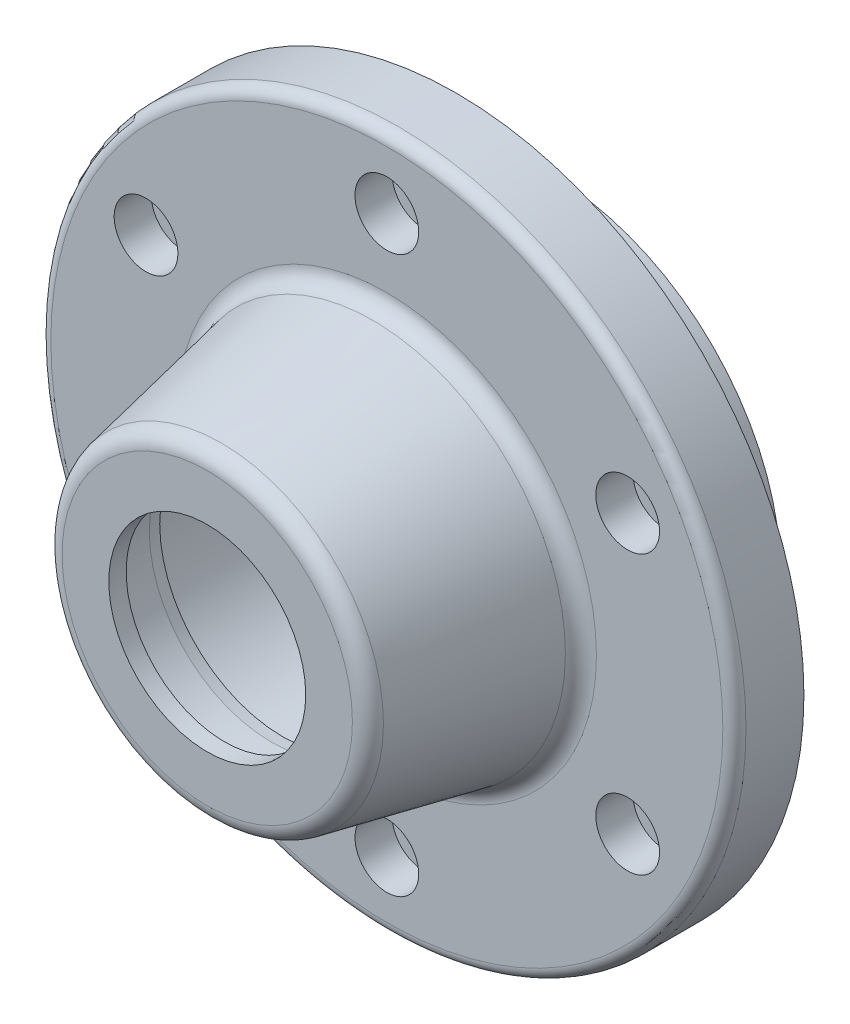
ISO-10303-21;
HEADER;
FILE_DESCRIPTION(('STEP AP214'),'2;1');
FILE_NAME('part.step','',(''),(''),'','','');
FILE_SCHEMA(('AUTOMOTIVE_DESIGN { 1 0 10303 214 1 1 1 1 }'));
ENDSEC;
DATA;
#1=APPLICATION_CONTEXT('core data for automotive mechanical design processes');
#2=APPLICATION_PROTOCOL_DEFINITION('international standard','automotive_design',2000,#1);
#3=PRODUCT_CONTEXT('',#1,'mechanical');
#4=PRODUCT('Part','Part','',(#3));
#5=PRODUCT_RELATED_PRODUCT_CATEGORY('part','',(#4));
#6=PRODUCT_DEFINITION_FORMATION('','',#4);
#7=PRODUCT_DEFINITION_CONTEXT('part definition',#1,'design');
#8=PRODUCT_DEFINITION('design','',#6,#7);
#9=PRODUCT_DEFINITION_SHAPE('','',#8);
#10=(LENGTH_UNIT() NAMED_UNIT(*) SI_UNIT(.MILLI.,.METRE.));
#11=(NAMED_UNIT(*) PLANE_ANGLE_UNIT() SI_UNIT($,.RADIAN.));
#12=(NAMED_UNIT(*) SI_UNIT($,.STERADIAN.) SOLID_ANGLE_UNIT());
#13=UNCERTAINTY_MEASURE_WITH_UNIT(LENGTH_MEASURE(1.E-05),#10,'distance_accuracy_value','');
#14=(GEOMETRIC_REPRESENTATION_CONTEXT(3) GLOBAL_UNCERTAINTY_ASSIGNED_CONTEXT((#13)) GLOBAL_UNIT_ASSIGNED_CONTEXT((#10,
#11,#12)) REPRESENTATION_CONTEXT('',''));
#15=CARTESIAN_POINT('',(0.,0.,0.));
#16=DIRECTION('',(0.,0.,1.));
#17=DIRECTION('',(1.,0.,0.));
#18=AXIS2_PLACEMENT_3D('',#15,#16,#17);
#19=CARTESIAN_POINT('',(0.,0.,82.7475601325887));
#20=DIRECTION('',(0.,0.,1.));
#21=DIRECTION('',(1.,0.,0.));
#22=AXIS2_PLACEMENT_3D('',#19,#20,#21);
#23=CYLINDRICAL_SURFACE('',#22,17.);
#24=CARTESIAN_POINT('',(0.,0.,63.));
#25=DIRECTION('',(0.,0.,1.));
#26=DIRECTION('',(1.,0.,0.));
#27=AXIS2_PLACEMENT_3D('',#24,#25,#26);
#28=CIRCLE('',#27,17.);
#29=CARTESIAN_POINT('',(17.,0.,63.));
#30=VERTEX_POINT('',#29);
#31=EDGE_CURVE('E10',#30,#30,#28,.T.);
#32=ORIENTED_EDGE('',*,*,#31,.T.);
#33=EDGE_LOOP('',(#32));
#34=FACE_BOUND('',#33,.T.);
#35=CARTESIAN_POINT('',(0.,0.,60.));
#36=DIRECTION('',(0.,0.,1.));
#37=DIRECTION('',(1.,0.,0.));
#38=AXIS2_PLACEMENT_3D('',#35,#36,#37);
#39=CIRCLE('',#38,17.);
#40=CARTESIAN_POINT('',(17.,0.,60.));
#41=VERTEX_POINT('',#40);
#42=EDGE_CURVE('E143',#41,#41,#39,.T.);
#43=ORIENTED_EDGE('',*,*,#42,.F.);
#44=EDGE_LOOP('',(#43));
#45=FACE_BOUND('',#44,.T.);
#46=ADVANCED_FACE('F36',(#34,#45),#23,.F.);
#47=CARTESIAN_POINT('',(0.,-17.,63.));
#48=DIRECTION('',(0.,0.,1.));
#49=DIRECTION('',(1.,0.,0.));
#50=AXIS2_PLACEMENT_3D('',#47,#48,#49);
#51=PLANE('',#50);
#52=CARTESIAN_POINT('',(0.,0.,63.));
#53=DIRECTION('',(0.,0.,1.));
#54=DIRECTION('',(1.,0.,0.));
#55=AXIS2_PLACEMENT_3D('',#52,#53,#54);
#56=CIRCLE('',#55,25.0582579729272);
#57=CARTESIAN_POINT('',(25.0582579729272,0.,63.));
#58=VERTEX_POINT('',#57);
#59=EDGE_CURVE('E43',#58,#58,#56,.T.);
#60=ORIENTED_EDGE('',*,*,#59,.T.);
#61=EDGE_LOOP('',(#60));
#62=FACE_BOUND('',#61,.T.);
#63=ORIENTED_EDGE('',*,*,#31,.F.);
#64=EDGE_LOOP('',(#63));
#65=FACE_BOUND('',#64,.T.);
#66=ADVANCED_FACE('F280',(#62,#65),#51,.T.);
#67=CARTESIAN_POINT('',(0.,0.,60.));
#68=DIRECTION('',(0.,0.,1.));
#69=DIRECTION('',(1.,0.,0.));
#70=AXIS2_PLACEMENT_3D('',#67,#68,#69);
#71=TOROIDAL_SURFACE('',#70,25.0582579729272,3.00000000000001);
#72=CARTESIAN_POINT('',(0.,0.,60.5883484054146));
#73=DIRECTION('',(0.,0.,1.));
#74=DIRECTION('',(1.,0.,0.));
#75=AXIS2_PLACEMENT_3D('',#72,#73,#74);
#76=CIRCLE('',#75,28.);
#77=CARTESIAN_POINT('',(28.,0.,60.5883484054146));
#78=VERTEX_POINT('',#77);
#79=EDGE_CURVE('E48',#78,#78,#76,.T.);
#80=ORIENTED_EDGE('',*,*,#79,.T.);
#81=EDGE_LOOP('',(#80));
#82=FACE_BOUND('',#81,.T.);
#83=ORIENTED_EDGE('',*,*,#59,.F.);
#84=EDGE_LOOP('',(#83));
#85=FACE_BOUND('',#84,.T.);
#86=ADVANCED_FACE('F274',(#82,#85),#71,.T.);
#87=CARTESIAN_POINT('',(0.,0.,60.5883484054146));
#88=DIRECTION('',(0.,0.,-1.));
#89=DIRECTION('',(-1.,0.,0.));
#90=AXIS2_PLACEMENT_3D('',#87,#88,#89);
#91=CONICAL_SURFACE('',#90,28.,0.197395559849877);
#92=CARTESIAN_POINT('',(0.,0.,34.4116515945855));
#93=DIRECTION('',(0.,0.,1.));
#94=DIRECTION('',(1.,0.,0.));
#95=AXIS2_PLACEMENT_3D('',#92,#93,#94);
#96=CIRCLE('',#95,33.2353393621657);
#97=CARTESIAN_POINT('',(33.2353393621657,0.,34.4116515945855));
#98=VERTEX_POINT('',#97);
#99=EDGE_CURVE('E53',#98,#98,#96,.T.);
#100=ORIENTED_EDGE('',*,*,#99,.T.);
#101=EDGE_LOOP('',(#100));
#102=FACE_BOUND('',#101,.T.);
#103=ORIENTED_EDGE('',*,*,#79,.F.);
#104=EDGE_LOOP('',(#103));
#105=FACE_BOUND('',#104,.T.);
#106=ADVANCED_FACE('F268',(#102,#105),#91,.T.);
#107=CARTESIAN_POINT('',(0.,0.,35.));
#108=DIRECTION('',(0.,0.,1.));
#109=DIRECTION('',(1.,0.,0.));
#110=AXIS2_PLACEMENT_3D('',#107,#108,#109);
#111=TOROIDAL_SURFACE('',#110,36.1770813892385,3.00000000000001);
#112=CARTESIAN_POINT('',(0.,0.,32.));
#113=DIRECTION('',(0.,0.,1.));
#114=DIRECTION('',(1.,0.,0.));
#115=AXIS2_PLACEMENT_3D('',#112,#113,#114);
#116=CIRCLE('',#115,36.1770813892385);
#117=CARTESIAN_POINT('',(36.1770813892385,0.,32.));
#118=VERTEX_POINT('',#117);
#119=EDGE_CURVE('E59',#118,#118,#116,.T.);
#120=ORIENTED_EDGE('',*,*,#119,.T.);
#121=EDGE_LOOP('',(#120));
#122=FACE_BOUND('',#121,.T.);
#123=ORIENTED_EDGE('',*,*,#99,.F.);
#124=EDGE_LOOP('',(#123));
#125=FACE_BOUND('',#124,.T.);
#126=ADVANCED_FACE('F250',(#122,#125),#111,.F.);
#127=CARTESIAN_POINT('',(0.,-36.1770813892385,32.));
#128=DIRECTION('',(0.,0.,1.));
#129=DIRECTION('',(1.,0.,0.));
#130=AXIS2_PLACEMENT_3D('',#127,#128,#129);
#131=PLANE('',#130);
#132=CARTESIAN_POINT('',(-41.5692193816528,24.0000000000005,32.));
#133=DIRECTION('',(0.,0.,1.));
#134=DIRECTION('',(1.,0.,0.));
#135=AXIS2_PLACEMENT_3D('',#132,#133,#134);
#136=CIRCLE('',#135,5.50000000000001);
#137=CARTESIAN_POINT('',(-36.0692193816528,24.0000000000005,32.));
#138=VERTEX_POINT('',#137);
#139=EDGE_CURVE('E239',#138,#138,#136,.T.);
#140=ORIENTED_EDGE('',*,*,#139,.F.);
#141=EDGE_LOOP('',(#140));
#142=FACE_BOUND('',#141,.T.);
#143=CARTESIAN_POINT('',(-41.5692193816533,-23.9999999999996,32.));
#144=DIRECTION('',(0.,0.,1.));
#145=DIRECTION('',(1.,0.,0.));
#146=AXIS2_PLACEMENT_3D('',#143,#144,#145);
#147=CIRCLE('',#146,5.50000000000001);
#148=CARTESIAN_POINT('',(-36.0692193816533,-23.9999999999996,32.));
#149=VERTEX_POINT('',#148);
#150=EDGE_CURVE('E223',#149,#149,#147,.T.);
#151=ORIENTED_EDGE('',*,*,#150,.F.);
#152=EDGE_LOOP('',(#151));
#153=FACE_BOUND('',#152,.T.);
#154=CARTESIAN_POINT('',(0.,-48.,32.));
#155=DIRECTION('',(0.,0.,1.));
#156=DIRECTION('',(1.,0.,0.));
#157=AXIS2_PLACEMENT_3D('',#154,#155,#156);
#158=CIRCLE('',#157,5.50000000000001);
#159=CARTESIAN_POINT('',(5.50000000000001,-48.,32.));
#160=VERTEX_POINT('',#159);
#161=EDGE_CURVE('E207',#160,#160,#158,.T.);
#162=ORIENTED_EDGE('',*,*,#161,.F.);
#163=EDGE_LOOP('',(#162));
#164=FACE_BOUND('',#163,.T.);
#165=CARTESIAN_POINT('',(41.5692193816529,-24.0000000000002,32.));
#166=DIRECTION('',(0.,0.,1.));
#167=DIRECTION('',(1.,0.,0.));
#168=AXIS2_PLACEMENT_3D('',#165,#166,#167);
#169=CIRCLE('',#168,5.50000000000001);
#170=CARTESIAN_POINT('',(47.069219381653,-24.0000000000002,32.));
#171=VERTEX_POINT('',#170);
#172=EDGE_CURVE('E191',#171,#171,#169,.T.);
#173=ORIENTED_EDGE('',*,*,#172,.F.);
#174=EDGE_LOOP('',(#173));
#175=FACE_BOUND('',#174,.T.);
#176=CARTESIAN_POINT('',(41.5692193816531,23.9999999999999,32.));
#177=DIRECTION('',(0.,0.,1.));
#178=DIRECTION('',(1.,0.,0.));
#179=AXIS2_PLACEMENT_3D('',#176,#177,#178);
#180=CIRCLE('',#179,5.50000000000001);
#181=CARTESIAN_POINT('',(47.0692193816531,23.9999999999999,32.));
#182=VERTEX_POINT('',#181);
#183=EDGE_CURVE('E175',#182,#182,#180,.T.);
#184=ORIENTED_EDGE('',*,*,#183,.F.);
#185=EDGE_LOOP('',(#184));
#186=FACE_BOUND('',#185,.T.);
#187=CARTESIAN_POINT('',(0.,48.,32.));
#188=DIRECTION('',(0.,0.,1.));
#189=DIRECTION('',(1.,0.,0.));
#190=AXIS2_PLACEMENT_3D('',#187,#188,#189);
#191=CIRCLE('',#190,5.50000000000001);
#192=CARTESIAN_POINT('',(5.50000000000001,48.,32.));
#193=VERTEX_POINT('',#192);
#194=EDGE_CURVE('E159',#193,#193,#191,.T.);
#195=ORIENTED_EDGE('',*,*,#194,.F.);
#196=EDGE_LOOP('',(#195));
#197=FACE_BOUND('',#196,.T.);
#198=CARTESIAN_POINT('',(0.,0.,32.));
#199=DIRECTION('',(0.,0.,1.));
#200=DIRECTION('',(1.,0.,0.));
#201=AXIS2_PLACEMENT_3D('',#198,#199,#200);
#202=CIRCLE('',#201,58.);
#203=CARTESIAN_POINT('',(58.,0.,32.));
#204=VERTEX_POINT('',#203);
#205=EDGE_CURVE('E63',#204,#204,#202,.T.);
#206=ORIENTED_EDGE('',*,*,#205,.T.);
#207=EDGE_LOOP('',(#206));
#208=FACE_BOUND('',#207,.T.);
#209=ORIENTED_EDGE('',*,*,#119,.F.);
#210=EDGE_LOOP('',(#209));
#211=FACE_BOUND('',#210,.T.);
#212=ADVANCED_FACE('F246',(#142,#153,#164,#175,#186,#197,#208,#211),#131,.T.);
#213=CARTESIAN_POINT('',(0.,0.,30.));
#214=DIRECTION('',(0.,0.,1.));
#215=DIRECTION('',(1.,0.,0.));
#216=AXIS2_PLACEMENT_3D('',#213,#214,#215);
#217=TOROIDAL_SURFACE('',#216,58.,2.00000000000001);
#218=CARTESIAN_POINT('',(0.,0.,30.));
#219=DIRECTION('',(0.,0.,1.));
#220=DIRECTION('',(1.,0.,0.));
#221=AXIS2_PLACEMENT_3D('',#218,#219,#220);
#222=CIRCLE('',#221,60.);
#223=CARTESIAN_POINT('',(60.,0.,30.));
#224=VERTEX_POINT('',#223);
#225=EDGE_CURVE('E67',#224,#224,#222,.T.);
#226=ORIENTED_EDGE('',*,*,#225,.T.);
#227=EDGE_LOOP('',(#226));
#228=FACE_BOUND('',#227,.T.);
#229=ORIENTED_EDGE('',*,*,#205,.F.);
#230=EDGE_LOOP('',(#229));
#231=FACE_BOUND('',#230,.T.);
#232=ADVANCED_FACE('F249',(#228,#231),#217,.T.);
#233=CARTESIAN_POINT('',(0.,0.,82.7475601325887));
#234=DIRECTION('',(0.,0.,1.));
#235=DIRECTION('',(1.,0.,0.));
#236=AXIS2_PLACEMENT_3D('',#233,#234,#235);
#237=CYLINDRICAL_SURFACE('',#236,60.);
#238=CARTESIAN_POINT('',(0.,0.,20.));
#239=DIRECTION('',(0.,0.,1.));
#240=DIRECTION('',(1.,0.,0.));
#241=AXIS2_PLACEMENT_3D('',#238,#239,#240);
#242=CIRCLE('',#241,60.);
#243=CARTESIAN_POINT('',(60.,0.,20.));
#244=VERTEX_POINT('',#243);
#245=EDGE_CURVE('E71',#244,#244,#242,.T.);
#246=ORIENTED_EDGE('',*,*,#245,.T.);
#247=EDGE_LOOP('',(#246));
#248=FACE_BOUND('',#247,.T.);
#249=ORIENTED_EDGE('',*,*,#225,.F.);
#250=EDGE_LOOP('',(#249));
#251=FACE_BOUND('',#250,.T.);
#252=ADVANCED_FACE('F397',(#248,#251),#237,.T.);
#253=CARTESIAN_POINT('',(0.,-60.,20.));
#254=DIRECTION('',(0.,0.,-1.));
#255=DIRECTION('',(-1.,0.,0.));
#256=AXIS2_PLACEMENT_3D('',#253,#254,#255);
#257=PLANE('',#256);
#258=CARTESIAN_POINT('',(-41.5692193816528,24.0000000000005,20.));
#259=DIRECTION('',(0.,0.,-1.));
#260=DIRECTION('',(-1.,0.,0.));
#261=AXIS2_PLACEMENT_3D('',#258,#259,#260);
#262=CIRCLE('',#261,3.50000000000001);
#263=CARTESIAN_POINT('',(-45.0692193816528,24.0000000000005,20.));
#264=VERTEX_POINT('',#263);
#265=EDGE_CURVE('E227',#264,#264,#262,.T.);
#266=ORIENTED_EDGE('',*,*,#265,.F.);
#267=EDGE_LOOP('',(#266));
#268=FACE_BOUND('',#267,.T.);
#269=CARTESIAN_POINT('',(-41.5692193816533,-23.9999999999996,20.));
#270=DIRECTION('',(0.,0.,-1.));
#271=DIRECTION('',(-1.,0.,0.));
#272=AXIS2_PLACEMENT_3D('',#269,#270,#271);
#273=CIRCLE('',#272,3.50000000000001);
#274=CARTESIAN_POINT('',(-45.0692193816533,-23.9999999999996,20.));
#275=VERTEX_POINT('',#274);
#276=EDGE_CURVE('E211',#275,#275,#273,.T.);
#277=ORIENTED_EDGE('',*,*,#276,.F.);
#278=EDGE_LOOP('',(#277));
#279=FACE_BOUND('',#278,.T.);
#280=CARTESIAN_POINT('',(0.,-48.,20.));
#281=DIRECTION('',(0.,0.,-1.));
#282=DIRECTION('',(-1.,0.,0.));
#283=AXIS2_PLACEMENT_3D('',#280,#281,#282);
#284=CIRCLE('',#283,3.50000000000001);
#285=CARTESIAN_POINT('',(-3.50000000000001,-48.,20.));
#286=VERTEX_POINT('',#285);
#287=EDGE_CURVE('E195',#286,#286,#284,.T.);
#288=ORIENTED_EDGE('',*,*,#287,.F.);
#289=EDGE_LOOP('',(#288));
#290=FACE_BOUND('',#289,.T.);
#291=CARTESIAN_POINT('',(41.5692193816529,-24.0000000000002,20.));
#292=DIRECTION('',(0.,0.,-1.));
#293=DIRECTION('',(-1.,0.,0.));
#294=AXIS2_PLACEMENT_3D('',#291,#292,#293);
#295=CIRCLE('',#294,3.50000000000001);
#296=CARTESIAN_POINT('',(38.0692193816529,-24.0000000000002,20.));
#297=VERTEX_POINT('',#296);
#298=EDGE_CURVE('E179',#297,#297,#295,.T.);
#299=ORIENTED_EDGE('',*,*,#298,.F.);
#300=EDGE_LOOP('',(#299));
#301=FACE_BOUND('',#300,.T.);
#302=CARTESIAN_POINT('',(41.5692193816531,23.9999999999999,20.));
#303=DIRECTION('',(0.,0.,-1.));
#304=DIRECTION('',(-1.,0.,0.));
#305=AXIS2_PLACEMENT_3D('',#302,#303,#304);
#306=CIRCLE('',#305,3.50000000000001);
#307=CARTESIAN_POINT('',(38.0692193816531,23.9999999999999,20.));
#308=VERTEX_POINT('',#307);
#309=EDGE_CURVE('E163',#308,#308,#306,.T.);
#310=ORIENTED_EDGE('',*,*,#309,.F.);
#311=EDGE_LOOP('',(#310));
#312=FACE_BOUND('',#311,.T.);
#313=CARTESIAN_POINT('',(0.,48.,20.));
#314=DIRECTION('',(0.,0.,-1.));
#315=DIRECTION('',(-1.,0.,0.));
#316=AXIS2_PLACEMENT_3D('',#313,#314,#315);
#317=CIRCLE('',#316,3.50000000000001);
#318=CARTESIAN_POINT('',(-3.50000000000001,48.,20.));
#319=VERTEX_POINT('',#318);
#320=EDGE_CURVE('E147',#319,#319,#317,.T.);
#321=ORIENTED_EDGE('',*,*,#320,.F.);
#322=EDGE_LOOP('',(#321));
#323=FACE_BOUND('',#322,.T.);
#324=CARTESIAN_POINT('',(0.,0.,20.));
#325=DIRECTION('',(0.,0.,1.));
#326=DIRECTION('',(1.,0.,0.));
#327=AXIS2_PLACEMENT_3D('',#324,#325,#326);
#328=CIRCLE('',#327,40.);
#329=CARTESIAN_POINT('',(40.,0.,20.));
#330=VERTEX_POINT('',#329);
#331=EDGE_CURVE('E75',#330,#330,#328,.T.);
#332=ORIENTED_EDGE('',*,*,#331,.T.);
#333=EDGE_LOOP('',(#332));
#334=FACE_BOUND('',#333,.T.);
#335=ORIENTED_EDGE('',*,*,#245,.F.);
#336=EDGE_LOOP('',(#335));
#337=FACE_BOUND('',#336,.T.);
#338=ADVANCED_FACE('F391',(#268,#279,#290,#301,#312,#323,#334,#337),#257,.T.);
#339=CARTESIAN_POINT('',(0.,0.,82.7475601325887));
#340=DIRECTION('',(0.,0.,1.));
#341=DIRECTION('',(1.,0.,0.));
#342=AXIS2_PLACEMENT_3D('',#339,#340,#341);
#343=CYLINDRICAL_SURFACE('',#342,40.);
#344=CARTESIAN_POINT('',(0.,0.,4.));
#345=DIRECTION('',(0.,0.,1.));
#346=DIRECTION('',(1.,0.,0.));
#347=AXIS2_PLACEMENT_3D('',#344,#345,#346);
#348=CIRCLE('',#347,40.);
#349=CARTESIAN_POINT('',(40.,0.,4.));
#350=VERTEX_POINT('',#349);
#351=EDGE_CURVE('E79',#350,#350,#348,.T.);
#352=ORIENTED_EDGE('',*,*,#351,.T.);
#353=EDGE_LOOP('',(#352));
#354=FACE_BOUND('',#353,.T.);
#355=ORIENTED_EDGE('',*,*,#331,.F.);
#356=EDGE_LOOP('',(#355));
#357=FACE_BOUND('',#356,.T.);
#358=ADVANCED_FACE('F385',(#354,#357),#343,.T.);
#359=CARTESIAN_POINT('',(0.,-40.,4.));
#360=DIRECTION('',(0.,0.,-1.));
#361=DIRECTION('',(-1.,0.,0.));
#362=AXIS2_PLACEMENT_3D('',#359,#360,#361);
#363=PLANE('',#362);
#364=CARTESIAN_POINT('',(0.,0.,4.));
#365=DIRECTION('',(0.,0.,1.));
#366=DIRECTION('',(1.,0.,0.));
#367=AXIS2_PLACEMENT_3D('',#364,#365,#366);
#368=CIRCLE('',#367,31.);
#369=CARTESIAN_POINT('',(31.,0.,4.));
#370=VERTEX_POINT('',#369);
#371=EDGE_CURVE('E83',#370,#370,#368,.T.);
#372=ORIENTED_EDGE('',*,*,#371,.T.);
#373=EDGE_LOOP('',(#372));
#374=FACE_BOUND('',#373,.T.);
#375=ORIENTED_EDGE('',*,*,#351,.F.);
#376=EDGE_LOOP('',(#375));
#377=FACE_BOUND('',#376,.T.);
#378=ADVANCED_FACE('F379',(#374,#377),#363,.T.);
#379=CARTESIAN_POINT('',(0.,0.,82.7475601325887));
#380=DIRECTION('',(0.,0.,1.));
#381=DIRECTION('',(1.,0.,0.));
#382=AXIS2_PLACEMENT_3D('',#379,#380,#381);
#383=CYLINDRICAL_SURFACE('',#382,31.);
#384=CARTESIAN_POINT('',(0.,0.,0.));
#385=DIRECTION('',(0.,0.,1.));
#386=DIRECTION('',(1.,0.,0.));
#387=AXIS2_PLACEMENT_3D('',#384,#385,#386);
#388=CIRCLE('',#387,31.);
#389=CARTESIAN_POINT('',(31.,0.,0.));
#390=VERTEX_POINT('',#389);
#391=EDGE_CURVE('E87',#390,#390,#388,.T.);
#392=ORIENTED_EDGE('',*,*,#391,.T.);
#393=EDGE_LOOP('',(#392));
#394=FACE_BOUND('',#393,.T.);
#395=ORIENTED_EDGE('',*,*,#371,.F.);
#396=EDGE_LOOP('',(#395));
#397=FACE_BOUND('',#396,.T.);
#398=ADVANCED_FACE('F373',(#394,#397),#383,.T.);
#399=CARTESIAN_POINT('',(0.,-31.,0.));
#400=DIRECTION('',(0.,0.,-1.));
#401=DIRECTION('',(-1.,0.,0.));
#402=AXIS2_PLACEMENT_3D('',#399,#400,#401);
#403=PLANE('',#402);
#404=CARTESIAN_POINT('',(0.,0.,0.));
#405=DIRECTION('',(0.,0.,1.));
#406=DIRECTION('',(1.,0.,0.));
#407=AXIS2_PLACEMENT_3D('',#404,#405,#406);
#408=CIRCLE('',#407,23.75);
#409=CARTESIAN_POINT('',(23.75,0.,0.));
#410=VERTEX_POINT('',#409);
#411=EDGE_CURVE('E91',#410,#410,#408,.T.);
#412=ORIENTED_EDGE('',*,*,#411,.T.);
#413=EDGE_LOOP('',(#412));
#414=FACE_BOUND('',#413,.T.);
#415=ORIENTED_EDGE('',*,*,#391,.F.);
#416=EDGE_LOOP('',(#415));
#417=FACE_BOUND('',#416,.T.);
#418=ADVANCED_FACE('F367',(#414,#417),#403,.T.);
#419=CARTESIAN_POINT('',(0.,0.,82.7475601325887));
#420=DIRECTION('',(0.,0.,1.));
#421=DIRECTION('',(1.,0.,0.));
#422=AXIS2_PLACEMENT_3D('',#419,#420,#421);
#423=CYLINDRICAL_SURFACE('',#422,23.75);
#424=CARTESIAN_POINT('',(0.,0.,3.5));
#425=DIRECTION('',(0.,0.,1.));
#426=DIRECTION('',(1.,0.,0.));
#427=AXIS2_PLACEMENT_3D('',#424,#425,#426);
#428=CIRCLE('',#427,23.75);
#429=CARTESIAN_POINT('',(23.75,0.,3.5));
#430=VERTEX_POINT('',#429);
#431=EDGE_CURVE('E95',#430,#430,#428,.T.);
#432=ORIENTED_EDGE('',*,*,#431,.T.);
#433=EDGE_LOOP('',(#432));
#434=FACE_BOUND('',#433,.T.);
#435=ORIENTED_EDGE('',*,*,#411,.F.);
#436=EDGE_LOOP('',(#435));
#437=FACE_BOUND('',#436,.T.);
#438=ADVANCED_FACE('F361',(#434,#437),#423,.F.);
#439=CARTESIAN_POINT('',(0.,-23.75,3.5));
#440=DIRECTION('',(0.,0.,1.));
#441=DIRECTION('',(1.,0.,0.));
#442=AXIS2_PLACEMENT_3D('',#439,#440,#441);
#443=PLANE('',#442);
#444=CARTESIAN_POINT('',(0.,0.,3.5));
#445=DIRECTION('',(0.,0.,1.));
#446=DIRECTION('',(1.,0.,0.));
#447=AXIS2_PLACEMENT_3D('',#444,#445,#446);
#448=CIRCLE('',#447,24.75);
#449=CARTESIAN_POINT('',(24.75,0.,3.5));
#450=VERTEX_POINT('',#449);
#451=EDGE_CURVE('E99',#450,#450,#448,.T.);
#452=ORIENTED_EDGE('',*,*,#451,.T.);
#453=EDGE_LOOP('',(#452));
#454=FACE_BOUND('',#453,.T.);
#455=ORIENTED_EDGE('',*,*,#431,.F.);
#456=EDGE_LOOP('',(#455));
#457=FACE_BOUND('',#456,.T.);
#458=ADVANCED_FACE('F355',(#454,#457),#443,.T.);
#459=CARTESIAN_POINT('',(0.,0.,82.7475601325887));
#460=DIRECTION('',(0.,0.,1.));
#461=DIRECTION('',(1.,0.,0.));
#462=AXIS2_PLACEMENT_3D('',#459,#460,#461);
#463=CYLINDRICAL_SURFACE('',#462,24.75);
#464=CARTESIAN_POINT('',(0.,0.,5.35000000000001));
#465=DIRECTION('',(0.,0.,1.));
#466=DIRECTION('',(1.,0.,0.));
#467=AXIS2_PLACEMENT_3D('',#464,#465,#466);
#468=CIRCLE('',#467,24.75);
#469=CARTESIAN_POINT('',(24.75,0.,5.35000000000001));
#470=VERTEX_POINT('',#469);
#471=EDGE_CURVE('E103',#470,#470,#468,.T.);
#472=ORIENTED_EDGE('',*,*,#471,.T.);
#473=EDGE_LOOP('',(#472));
#474=FACE_BOUND('',#473,.T.);
#475=ORIENTED_EDGE('',*,*,#451,.F.);
#476=EDGE_LOOP('',(#475));
#477=FACE_BOUND('',#476,.T.);
#478=ADVANCED_FACE('F349',(#474,#477),#463,.F.);
#479=CARTESIAN_POINT('',(0.,-24.75,5.35));
#480=DIRECTION('',(0.,0.,-1.));
#481=DIRECTION('',(-1.,0.,0.));
#482=AXIS2_PLACEMENT_3D('',#479,#480,#481);
#483=PLANE('',#482);
#484=CARTESIAN_POINT('',(0.,0.,5.35000000000001));
#485=DIRECTION('',(0.,0.,1.));
#486=DIRECTION('',(1.,0.,0.));
#487=AXIS2_PLACEMENT_3D('',#484,#485,#486);
#488=CIRCLE('',#487,23.5);
#489=CARTESIAN_POINT('',(23.5,0.,5.35000000000001));
#490=VERTEX_POINT('',#489);
#491=EDGE_CURVE('E107',#490,#490,#488,.T.);
#492=ORIENTED_EDGE('',*,*,#491,.T.);
#493=EDGE_LOOP('',(#492));
#494=FACE_BOUND('',#493,.T.);
#495=ORIENTED_EDGE('',*,*,#471,.F.);
#496=EDGE_LOOP('',(#495));
#497=FACE_BOUND('',#496,.T.);
#498=ADVANCED_FACE('F343',(#494,#497),#483,.T.);
#499=CARTESIAN_POINT('',(0.,0.,82.7475601325887));
#500=DIRECTION('',(0.,0.,1.));
#501=DIRECTION('',(1.,0.,0.));
#502=AXIS2_PLACEMENT_3D('',#499,#500,#501);
#503=CYLINDRICAL_SURFACE('',#502,23.5);
#504=CARTESIAN_POINT('',(0.,0.,21.5));
#505=DIRECTION('',(0.,0.,1.));
#506=DIRECTION('',(1.,0.,0.));
#507=AXIS2_PLACEMENT_3D('',#504,#505,#506);
#508=CIRCLE('',#507,23.5);
#509=CARTESIAN_POINT('',(23.5,0.,21.5));
#510=VERTEX_POINT('',#509);
#511=EDGE_CURVE('E111',#510,#510,#508,.T.);
#512=ORIENTED_EDGE('',*,*,#511,.T.);
#513=EDGE_LOOP('',(#512));
#514=FACE_BOUND('',#513,.T.);
#515=ORIENTED_EDGE('',*,*,#491,.F.);
#516=EDGE_LOOP('',(#515));
#517=FACE_BOUND('',#516,.T.);
#518=ADVANCED_FACE('F337',(#514,#517),#503,.F.);
#519=CARTESIAN_POINT('',(0.,0.,23.5));
#520=DIRECTION('',(0.,0.,1.));
#521=DIRECTION('',(1.,0.,0.));
#522=AXIS2_PLACEMENT_3D('',#519,#520,#521);
#523=TOROIDAL_SURFACE('',#522,23.5,2.);
#524=CARTESIAN_POINT('',(0.,0.,23.5));
#525=DIRECTION('',(0.,0.,1.));
#526=DIRECTION('',(1.,0.,0.));
#527=AXIS2_PLACEMENT_3D('',#524,#525,#526);
#528=CIRCLE('',#527,25.5);
#529=CARTESIAN_POINT('',(25.5,0.,23.5));
#530=VERTEX_POINT('',#529);
#531=EDGE_CURVE('E115',#530,#530,#528,.T.);
#532=ORIENTED_EDGE('',*,*,#531,.T.);
#533=EDGE_LOOP('',(#532));
#534=FACE_BOUND('',#533,.T.);
#535=ORIENTED_EDGE('',*,*,#511,.F.);
#536=EDGE_LOOP('',(#535));
#537=FACE_BOUND('',#536,.T.);
#538=ADVANCED_FACE('F331',(#534,#537),#523,.F.);
#539=CARTESIAN_POINT('',(0.,0.,82.7475601325887));
#540=DIRECTION('',(0.,0.,1.));
#541=DIRECTION('',(1.,0.,0.));
#542=AXIS2_PLACEMENT_3D('',#539,#540,#541);
#543=CYLINDRICAL_SURFACE('',#542,25.5);
#544=CARTESIAN_POINT('',(0.,0.,32.));
#545=DIRECTION('',(0.,0.,1.));
#546=DIRECTION('',(1.,0.,0.));
#547=AXIS2_PLACEMENT_3D('',#544,#545,#546);
#548=CIRCLE('',#547,25.5);
#549=CARTESIAN_POINT('',(25.5,0.,32.));
#550=VERTEX_POINT('',#549);
#551=EDGE_CURVE('E119',#550,#550,#548,.T.);
#552=ORIENTED_EDGE('',*,*,#551,.T.);
#553=EDGE_LOOP('',(#552));
#554=FACE_BOUND('',#553,.T.);
#555=ORIENTED_EDGE('',*,*,#531,.F.);
#556=EDGE_LOOP('',(#555));
#557=FACE_BOUND('',#556,.T.);
#558=ADVANCED_FACE('F325',(#554,#557),#543,.F.);
#559=CARTESIAN_POINT('',(0.,0.,32.));
#560=DIRECTION('',(0.,0.,1.));
#561=DIRECTION('',(1.,0.,0.));
#562=AXIS2_PLACEMENT_3D('',#559,#560,#561);
#563=TOROIDAL_SURFACE('',#562,23.5,2.00000000000001);
#564=CARTESIAN_POINT('',(0.,0.,34.));
#565=DIRECTION('',(0.,0.,1.));
#566=DIRECTION('',(1.,0.,0.));
#567=AXIS2_PLACEMENT_3D('',#564,#565,#566);
#568=CIRCLE('',#567,23.5);
#569=CARTESIAN_POINT('',(23.5,0.,34.));
#570=VERTEX_POINT('',#569);
#571=EDGE_CURVE('E123',#570,#570,#568,.T.);
#572=ORIENTED_EDGE('',*,*,#571,.T.);
#573=EDGE_LOOP('',(#572));
#574=FACE_BOUND('',#573,.T.);
#575=ORIENTED_EDGE('',*,*,#551,.F.);
#576=EDGE_LOOP('',(#575));
#577=FACE_BOUND('',#576,.T.);
#578=ADVANCED_FACE('F319',(#574,#577),#563,.F.);
#579=CARTESIAN_POINT('',(0.,0.,82.7475601325887));
#580=DIRECTION('',(0.,0.,1.));
#581=DIRECTION('',(1.,0.,0.));
#582=AXIS2_PLACEMENT_3D('',#579,#580,#581);
#583=CYLINDRICAL_SURFACE('',#582,23.5);
#584=CARTESIAN_POINT('',(0.,0.,50.));
#585=DIRECTION('',(0.,0.,1.));
#586=DIRECTION('',(1.,0.,0.));
#587=AXIS2_PLACEMENT_3D('',#584,#585,#586);
#588=CIRCLE('',#587,23.5);
#589=CARTESIAN_POINT('',(23.5,0.,50.));
#590=VERTEX_POINT('',#589);
#591=EDGE_CURVE('E127',#590,#590,#588,.T.);
#592=ORIENTED_EDGE('',*,*,#591,.T.);
#593=EDGE_LOOP('',(#592));
#594=FACE_BOUND('',#593,.T.);
#595=ORIENTED_EDGE('',*,*,#571,.F.);
#596=EDGE_LOOP('',(#595));
#597=FACE_BOUND('',#596,.T.);
#598=ADVANCED_FACE('F313',(#594,#597),#583,.F.);
#599=CARTESIAN_POINT('',(0.,-23.5,50.));
#600=DIRECTION('',(0.,0.,-1.));
#601=DIRECTION('',(-1.,0.,0.));
#602=AXIS2_PLACEMENT_3D('',#599,#600,#601);
#603=PLANE('',#602);
#604=CARTESIAN_POINT('',(0.,0.,50.));
#605=DIRECTION('',(0.,0.,1.));
#606=DIRECTION('',(1.,0.,0.));
#607=AXIS2_PLACEMENT_3D('',#604,#605,#606);
#608=CIRCLE('',#607,21.2102084705314);
#609=CARTESIAN_POINT('',(21.2102084705314,0.,50.));
#610=VERTEX_POINT('',#609);
#611=EDGE_CURVE('E131',#610,#610,#608,.T.);
#612=ORIENTED_EDGE('',*,*,#611,.T.);
#613=EDGE_LOOP('',(#612));
#614=FACE_BOUND('',#613,.T.);
#615=ORIENTED_EDGE('',*,*,#591,.F.);
#616=EDGE_LOOP('',(#615));
#617=FACE_BOUND('',#616,.T.);
#618=ADVANCED_FACE('F307',(#614,#617),#603,.T.);
#619=CARTESIAN_POINT('',(0.,0.,50.));
#620=DIRECTION('',(0.,0.,-1.));
#621=DIRECTION('',(-1.,0.,0.));
#622=AXIS2_PLACEMENT_3D('',#619,#620,#621);
#623=CONICAL_SURFACE('',#622,21.2102084705314,0.10471975511966);
#624=CARTESIAN_POINT('',(0.,0.,52.));
#625=DIRECTION('',(0.,0.,1.));
#626=DIRECTION('',(1.,0.,0.));
#627=AXIS2_PLACEMENT_3D('',#624,#625,#626);
#628=CIRCLE('',#627,21.);
#629=CARTESIAN_POINT('',(21.,0.,52.));
#630=VERTEX_POINT('',#629);
#631=EDGE_CURVE('E135',#630,#630,#628,.T.);
#632=ORIENTED_EDGE('',*,*,#631,.T.);
#633=EDGE_LOOP('',(#632));
#634=FACE_BOUND('',#633,.T.);
#635=ORIENTED_EDGE('',*,*,#611,.F.);
#636=EDGE_LOOP('',(#635));
#637=FACE_BOUND('',#636,.T.);
#638=ADVANCED_FACE('F301',(#634,#637),#623,.F.);
#639=CARTESIAN_POINT('',(0.,0.,82.7475601325887));
#640=DIRECTION('',(0.,0.,1.));
#641=DIRECTION('',(1.,0.,0.));
#642=AXIS2_PLACEMENT_3D('',#639,#640,#641);
#643=CYLINDRICAL_SURFACE('',#642,21.);
#644=CARTESIAN_POINT('',(0.,0.,60.));
#645=DIRECTION('',(0.,0.,1.));
#646=DIRECTION('',(1.,0.,0.));
#647=AXIS2_PLACEMENT_3D('',#644,#645,#646);
#648=CIRCLE('',#647,21.);
#649=CARTESIAN_POINT('',(21.,0.,60.));
#650=VERTEX_POINT('',#649);
#651=EDGE_CURVE('E139',#650,#650,#648,.T.);
#652=ORIENTED_EDGE('',*,*,#651,.T.);
#653=EDGE_LOOP('',(#652));
#654=FACE_BOUND('',#653,.T.);
#655=ORIENTED_EDGE('',*,*,#631,.F.);
#656=EDGE_LOOP('',(#655));
#657=FACE_BOUND('',#656,.T.);
#658=ADVANCED_FACE('F295',(#654,#657),#643,.F.);
#659=CARTESIAN_POINT('',(0.,-21.,60.));
#660=DIRECTION('',(0.,0.,-1.));
#661=DIRECTION('',(-1.,0.,0.));
#662=AXIS2_PLACEMENT_3D('',#659,#660,#661);
#663=PLANE('',#662);
#664=ORIENTED_EDGE('',*,*,#42,.T.);
#665=EDGE_LOOP('',(#664));
#666=FACE_BOUND('',#665,.T.);
#667=ORIENTED_EDGE('',*,*,#651,.F.);
#668=EDGE_LOOP('',(#667));
#669=FACE_BOUND('',#668,.T.);
#670=ADVANCED_FACE('F291',(#666,#669),#663,.T.);
#671=CARTESIAN_POINT('',(0.,48.,32.));
#672=DIRECTION('',(0.,0.,1.));
#673=DIRECTION('',(1.,0.,0.));
#674=AXIS2_PLACEMENT_3D('',#671,#672,#673);
#675=CYLINDRICAL_SURFACE('',#674,3.50000000000001);
#676=CARTESIAN_POINT('',(0.,48.,25.6));
#677=DIRECTION('',(0.,0.,1.));
#678=DIRECTION('',(1.,0.,0.));
#679=AXIS2_PLACEMENT_3D('',#676,#677,#678);
#680=CIRCLE('',#679,3.50000000000001);
#681=CARTESIAN_POINT('',(3.50000000000001,48.,25.6));
#682=VERTEX_POINT('',#681);
#683=EDGE_CURVE('E151',#682,#682,#680,.T.);
#684=ORIENTED_EDGE('',*,*,#683,.T.);
#685=EDGE_LOOP('',(#684));
#686=FACE_BOUND('',#685,.T.);
#687=ORIENTED_EDGE('',*,*,#320,.T.);
#688=EDGE_LOOP('',(#687));
#689=FACE_BOUND('',#688,.T.);
#690=ADVANCED_FACE('F294',(#686,#689),#675,.F.);
#691=CARTESIAN_POINT('',(3.50000000000001,48.,25.6));
#692=DIRECTION('',(0.,0.,-1.));
#693=DIRECTION('',(-1.,0.,0.));
#694=AXIS2_PLACEMENT_3D('',#691,#692,#693);
#695=PLANE('',#694);
#696=ORIENTED_EDGE('',*,*,#683,.F.);
#697=EDGE_LOOP('',(#696));
#698=FACE_BOUND('',#697,.T.);
#699=CARTESIAN_POINT('',(0.,48.,25.6));
#700=DIRECTION('',(0.,0.,1.));
#701=DIRECTION('',(1.,0.,0.));
#702=AXIS2_PLACEMENT_3D('',#699,#700,#701);
#703=CIRCLE('',#702,5.50000000000001);
#704=CARTESIAN_POINT('',(5.50000000000001,48.,25.6));
#705=VERTEX_POINT('',#704);
#706=EDGE_CURVE('E155',#705,#705,#703,.T.);
#707=ORIENTED_EDGE('',*,*,#706,.T.);
#708=EDGE_LOOP('',(#707));
#709=FACE_BOUND('',#708,.T.);
#710=ADVANCED_FACE('F415',(#698,#709),#695,.F.);
#711=CARTESIAN_POINT('',(0.,48.,32.));
#712=DIRECTION('',(0.,0.,1.));
#713=DIRECTION('',(1.,0.,0.));
#714=AXIS2_PLACEMENT_3D('',#711,#712,#713);
#715=CYLINDRICAL_SURFACE('',#714,5.50000000000001);
#716=ORIENTED_EDGE('',*,*,#706,.F.);
#717=EDGE_LOOP('',(#716));
#718=FACE_BOUND('',#717,.T.);
#719=ORIENTED_EDGE('',*,*,#194,.T.);
#720=EDGE_LOOP('',(#719));
#721=FACE_BOUND('',#720,.T.);
#722=ADVANCED_FACE('F419',(#718,#721),#715,.F.);
#723=CARTESIAN_POINT('',(41.5692193816531,23.9999999999999,32.));
#724=DIRECTION('',(0.,0.,1.));
#725=DIRECTION('',(1.,0.,0.));
#726=AXIS2_PLACEMENT_3D('',#723,#724,#725);
#727=CYLINDRICAL_SURFACE('',#726,3.50000000000001);
#728=CARTESIAN_POINT('',(41.5692193816531,23.9999999999999,25.6));
#729=DIRECTION('',(0.,0.,1.));
#730=DIRECTION('',(1.,0.,0.));
#731=AXIS2_PLACEMENT_3D('',#728,#729,#730);
#732=CIRCLE('',#731,3.50000000000001);
#733=CARTESIAN_POINT('',(45.0692193816531,23.9999999999999,25.6));
#734=VERTEX_POINT('',#733);
#735=EDGE_CURVE('E167',#734,#734,#732,.T.);
#736=ORIENTED_EDGE('',*,*,#735,.T.);
#737=EDGE_LOOP('',(#736));
#738=FACE_BOUND('',#737,.T.);
#739=ORIENTED_EDGE('',*,*,#309,.T.);
#740=EDGE_LOOP('',(#739));
#741=FACE_BOUND('',#740,.T.);
#742=ADVANCED_FACE('F423',(#738,#741),#727,.F.);
#743=CARTESIAN_POINT('',(45.0692193816531,23.9999999999999,25.6));
#744=DIRECTION('',(0.,0.,-1.));
#745=DIRECTION('',(-1.,0.,0.));
#746=AXIS2_PLACEMENT_3D('',#743,#744,#745);
#747=PLANE('',#746);
#748=ORIENTED_EDGE('',*,*,#735,.F.);
#749=EDGE_LOOP('',(#748));
#750=FACE_BOUND('',#749,.T.);
#751=CARTESIAN_POINT('',(41.5692193816531,23.9999999999999,25.6));
#752=DIRECTION('',(0.,0.,1.));
#753=DIRECTION('',(1.,0.,0.));
#754=AXIS2_PLACEMENT_3D('',#751,#752,#753);
#755=CIRCLE('',#754,5.50000000000001);
#756=CARTESIAN_POINT('',(47.0692193816531,23.9999999999999,25.6));
#757=VERTEX_POINT('',#756);
#758=EDGE_CURVE('E171',#757,#757,#755,.T.);
#759=ORIENTED_EDGE('',*,*,#758,.T.);
#760=EDGE_LOOP('',(#759));
#761=FACE_BOUND('',#760,.T.);
#762=ADVANCED_FACE('F427',(#750,#761),#747,.F.);
#763=CARTESIAN_POINT('',(41.5692193816531,23.9999999999999,32.));
#764=DIRECTION('',(0.,0.,1.));
#765=DIRECTION('',(1.,0.,0.));
#766=AXIS2_PLACEMENT_3D('',#763,#764,#765);
#767=CYLINDRICAL_SURFACE('',#766,5.50000000000001);
#768=ORIENTED_EDGE('',*,*,#758,.F.);
#769=EDGE_LOOP('',(#768));
#770=FACE_BOUND('',#769,.T.);
#771=ORIENTED_EDGE('',*,*,#183,.T.);
#772=EDGE_LOOP('',(#771));
#773=FACE_BOUND('',#772,.T.);
#774=ADVANCED_FACE('F431',(#770,#773),#767,.F.);
#775=CARTESIAN_POINT('',(41.5692193816529,-24.0000000000002,32.));
#776=DIRECTION('',(0.,0.,1.));
#777=DIRECTION('',(1.,0.,0.));
#778=AXIS2_PLACEMENT_3D('',#775,#776,#777);
#779=CYLINDRICAL_SURFACE('',#778,3.50000000000001);
#780=CARTESIAN_POINT('',(41.5692193816529,-24.0000000000002,25.6));
#781=DIRECTION('',(0.,0.,1.));
#782=DIRECTION('',(1.,0.,0.));
#783=AXIS2_PLACEMENT_3D('',#780,#781,#782);
#784=CIRCLE('',#783,3.50000000000001);
#785=CARTESIAN_POINT('',(45.069219381653,-24.0000000000002,25.6));
#786=VERTEX_POINT('',#785);
#787=EDGE_CURVE('E183',#786,#786,#784,.T.);
#788=ORIENTED_EDGE('',*,*,#787,.T.);
#789=EDGE_LOOP('',(#788));
#790=FACE_BOUND('',#789,.T.);
#791=ORIENTED_EDGE('',*,*,#298,.T.);
#792=EDGE_LOOP('',(#791));
#793=FACE_BOUND('',#792,.T.);
#794=ADVANCED_FACE('F435',(#790,#793),#779,.F.);
#795=CARTESIAN_POINT('',(45.069219381653,-24.0000000000002,25.6));
#796=DIRECTION('',(0.,0.,-1.));
#797=DIRECTION('',(-1.,0.,0.));
#798=AXIS2_PLACEMENT_3D('',#795,#796,#797);
#799=PLANE('',#798);
#800=ORIENTED_EDGE('',*,*,#787,.F.);
#801=EDGE_LOOP('',(#800));
#802=FACE_BOUND('',#801,.T.);
#803=CARTESIAN_POINT('',(41.5692193816529,-24.0000000000002,25.6));
#804=DIRECTION('',(0.,0.,1.));
#805=DIRECTION('',(1.,0.,0.));
#806=AXIS2_PLACEMENT_3D('',#803,#804,#805);
#807=CIRCLE('',#806,5.50000000000001);
#808=CARTESIAN_POINT('',(47.069219381653,-24.0000000000002,25.6));
#809=VERTEX_POINT('',#808);
#810=EDGE_CURVE('E187',#809,#809,#807,.T.);
#811=ORIENTED_EDGE('',*,*,#810,.T.);
#812=EDGE_LOOP('',(#811));
#813=FACE_BOUND('',#812,.T.);
#814=ADVANCED_FACE('F439',(#802,#813),#799,.F.);
#815=CARTESIAN_POINT('',(41.5692193816529,-24.0000000000002,32.));
#816=DIRECTION('',(0.,0.,1.));
#817=DIRECTION('',(1.,0.,0.));
#818=AXIS2_PLACEMENT_3D('',#815,#816,#817);
#819=CYLINDRICAL_SURFACE('',#818,5.50000000000001);
#820=ORIENTED_EDGE('',*,*,#810,.F.);
#821=EDGE_LOOP('',(#820));
#822=FACE_BOUND('',#821,.T.);
#823=ORIENTED_EDGE('',*,*,#172,.T.);
#824=EDGE_LOOP('',(#823));
#825=FACE_BOUND('',#824,.T.);
#826=ADVANCED_FACE('F443',(#822,#825),#819,.F.);
#827=CARTESIAN_POINT('',(0.,-48.,32.));
#828=DIRECTION('',(0.,0.,1.));
#829=DIRECTION('',(1.,0.,0.));
#830=AXIS2_PLACEMENT_3D('',#827,#828,#829);
#831=CYLINDRICAL_SURFACE('',#830,3.50000000000001);
#832=CARTESIAN_POINT('',(0.,-48.,25.6));
#833=DIRECTION('',(0.,0.,1.));
#834=DIRECTION('',(1.,0.,0.));
#835=AXIS2_PLACEMENT_3D('',#832,#833,#834);
#836=CIRCLE('',#835,3.50000000000001);
#837=CARTESIAN_POINT('',(3.50000000000001,-48.,25.6));
#838=VERTEX_POINT('',#837);
#839=EDGE_CURVE('E199',#838,#838,#836,.T.);
#840=ORIENTED_EDGE('',*,*,#839,.T.);
#841=EDGE_LOOP('',(#840));
#842=FACE_BOUND('',#841,.T.);
#843=ORIENTED_EDGE('',*,*,#287,.T.);
#844=EDGE_LOOP('',(#843));
#845=FACE_BOUND('',#844,.T.);
#846=ADVANCED_FACE('F447',(#842,#845),#831,.F.);
#847=CARTESIAN_POINT('',(3.50000000000001,-48.,25.6));
#848=DIRECTION('',(0.,0.,-1.));
#849=DIRECTION('',(-1.,0.,0.));
#850=AXIS2_PLACEMENT_3D('',#847,#848,#849);
#851=PLANE('',#850);
#852=ORIENTED_EDGE('',*,*,#839,.F.);
#853=EDGE_LOOP('',(#852));
#854=FACE_BOUND('',#853,.T.);
#855=CARTESIAN_POINT('',(0.,-48.,25.6));
#856=DIRECTION('',(0.,0.,1.));
#857=DIRECTION('',(1.,0.,0.));
#858=AXIS2_PLACEMENT_3D('',#855,#856,#857);
#859=CIRCLE('',#858,5.50000000000001);
#860=CARTESIAN_POINT('',(5.50000000000001,-48.,25.6));
#861=VERTEX_POINT('',#860);
#862=EDGE_CURVE('E203',#861,#861,#859,.T.);
#863=ORIENTED_EDGE('',*,*,#862,.T.);
#864=EDGE_LOOP('',(#863));
#865=FACE_BOUND('',#864,.T.);
#866=ADVANCED_FACE('F451',(#854,#865),#851,.F.);
#867=CARTESIAN_POINT('',(0.,-48.,32.));
#868=DIRECTION('',(0.,0.,1.));
#869=DIRECTION('',(1.,0.,0.));
#870=AXIS2_PLACEMENT_3D('',#867,#868,#869);
#871=CYLINDRICAL_SURFACE('',#870,5.50000000000001);
#872=ORIENTED_EDGE('',*,*,#862,.F.);
#873=EDGE_LOOP('',(#872));
#874=FACE_BOUND('',#873,.T.);
#875=ORIENTED_EDGE('',*,*,#161,.T.);
#876=EDGE_LOOP('',(#875));
#877=FACE_BOUND('',#876,.T.);
#878=ADVANCED_FACE('F455',(#874,#877),#871,.F.);
#879=CARTESIAN_POINT('',(-41.5692193816533,-23.9999999999996,32.));
#880=DIRECTION('',(0.,0.,1.));
#881=DIRECTION('',(1.,0.,0.));
#882=AXIS2_PLACEMENT_3D('',#879,#880,#881);
#883=CYLINDRICAL_SURFACE('',#882,3.50000000000001);
#884=CARTESIAN_POINT('',(-41.5692193816533,-23.9999999999996,25.6));
#885=DIRECTION('',(0.,0.,1.));
#886=DIRECTION('',(1.,0.,0.));
#887=AXIS2_PLACEMENT_3D('',#884,#885,#886);
#888=CIRCLE('',#887,3.50000000000001);
#889=CARTESIAN_POINT('',(-38.0692193816533,-23.9999999999996,25.6));
#890=VERTEX_POINT('',#889);
#891=EDGE_CURVE('E215',#890,#890,#888,.T.);
#892=ORIENTED_EDGE('',*,*,#891,.T.);
#893=EDGE_LOOP('',(#892));
#894=FACE_BOUND('',#893,.T.);
#895=ORIENTED_EDGE('',*,*,#276,.T.);
#896=EDGE_LOOP('',(#895));
#897=FACE_BOUND('',#896,.T.);
#898=ADVANCED_FACE('F459',(#894,#897),#883,.F.);
#899=CARTESIAN_POINT('',(-38.0692193816533,-23.9999999999996,25.6));
#900=DIRECTION('',(0.,0.,-1.));
#901=DIRECTION('',(-1.,0.,0.));
#902=AXIS2_PLACEMENT_3D('',#899,#900,#901);
#903=PLANE('',#902);
#904=ORIENTED_EDGE('',*,*,#891,.F.);
#905=EDGE_LOOP('',(#904));
#906=FACE_BOUND('',#905,.T.);
#907=CARTESIAN_POINT('',(-41.5692193816533,-23.9999999999996,25.6));
#908=DIRECTION('',(0.,0.,1.));
#909=DIRECTION('',(1.,0.,0.));
#910=AXIS2_PLACEMENT_3D('',#907,#908,#909);
#911=CIRCLE('',#910,5.50000000000001);
#912=CARTESIAN_POINT('',(-36.0692193816533,-23.9999999999996,25.6));
#913=VERTEX_POINT('',#912);
#914=EDGE_CURVE('E219',#913,#913,#911,.T.);
#915=ORIENTED_EDGE('',*,*,#914,.T.);
#916=EDGE_LOOP('',(#915));
#917=FACE_BOUND('',#916,.T.);
#918=ADVANCED_FACE('F463',(#906,#917),#903,.F.);
#919=CARTESIAN_POINT('',(-41.5692193816533,-23.9999999999996,32.));
#920=DIRECTION('',(0.,0.,1.));
#921=DIRECTION('',(1.,0.,0.));
#922=AXIS2_PLACEMENT_3D('',#919,#920,#921);
#923=CYLINDRICAL_SURFACE('',#922,5.50000000000001);
#924=ORIENTED_EDGE('',*,*,#914,.F.);
#925=EDGE_LOOP('',(#924));
#926=FACE_BOUND('',#925,.T.);
#927=ORIENTED_EDGE('',*,*,#150,.T.);
#928=EDGE_LOOP('',(#927));
#929=FACE_BOUND('',#928,.T.);
#930=ADVANCED_FACE('F467',(#926,#929),#923,.F.);
#931=CARTESIAN_POINT('',(-41.5692193816528,24.0000000000005,32.));
#932=DIRECTION('',(0.,0.,1.));
#933=DIRECTION('',(1.,0.,0.));
#934=AXIS2_PLACEMENT_3D('',#931,#932,#933);
#935=CYLINDRICAL_SURFACE('',#934,3.50000000000001);
#936=CARTESIAN_POINT('',(-41.5692193816528,24.0000000000005,25.6));
#937=DIRECTION('',(0.,0.,1.));
#938=DIRECTION('',(1.,0.,0.));
#939=AXIS2_PLACEMENT_3D('',#936,#937,#938);
#940=CIRCLE('',#939,3.50000000000001);
#941=CARTESIAN_POINT('',(-38.0692193816528,24.0000000000005,25.6));
#942=VERTEX_POINT('',#941);
#943=EDGE_CURVE('E231',#942,#942,#940,.T.);
#944=ORIENTED_EDGE('',*,*,#943,.T.);
#945=EDGE_LOOP('',(#944));
#946=FACE_BOUND('',#945,.T.);
#947=ORIENTED_EDGE('',*,*,#265,.T.);
#948=EDGE_LOOP('',(#947));
#949=FACE_BOUND('',#948,.T.);
#950=ADVANCED_FACE('F471',(#946,#949),#935,.F.);
#951=CARTESIAN_POINT('',(-38.0692193816528,24.0000000000005,25.6));
#952=DIRECTION('',(0.,0.,-1.));
#953=DIRECTION('',(-1.,0.,0.));
#954=AXIS2_PLACEMENT_3D('',#951,#952,#953);
#955=PLANE('',#954);
#956=ORIENTED_EDGE('',*,*,#943,.F.);
#957=EDGE_LOOP('',(#956));
#958=FACE_BOUND('',#957,.T.);
#959=CARTESIAN_POINT('',(-41.5692193816528,24.0000000000005,25.6));
#960=DIRECTION('',(0.,0.,1.));
#961=DIRECTION('',(1.,0.,0.));
#962=AXIS2_PLACEMENT_3D('',#959,#960,#961);
#963=CIRCLE('',#962,5.50000000000001);
#964=CARTESIAN_POINT('',(-36.0692193816528,24.0000000000005,25.6));
#965=VERTEX_POINT('',#964);
#966=EDGE_CURVE('E235',#965,#965,#963,.T.);
#967=ORIENTED_EDGE('',*,*,#966,.T.);
#968=EDGE_LOOP('',(#967));
#969=FACE_BOUND('',#968,.T.);
#970=ADVANCED_FACE('F475',(#958,#969),#955,.F.);
#971=CARTESIAN_POINT('',(-41.5692193816528,24.0000000000005,32.));
#972=DIRECTION('',(0.,0.,1.));
#973=DIRECTION('',(1.,0.,0.));
#974=AXIS2_PLACEMENT_3D('',#971,#972,#973);
#975=CYLINDRICAL_SURFACE('',#974,5.50000000000001);
#976=ORIENTED_EDGE('',*,*,#966,.F.);
#977=EDGE_LOOP('',(#976));
#978=FACE_BOUND('',#977,.T.);
#979=ORIENTED_EDGE('',*,*,#139,.T.);
#980=EDGE_LOOP('',(#979));
#981=FACE_BOUND('',#980,.T.);
#982=ADVANCED_FACE('F244',(#978,#981),#975,.F.);
#983=CLOSED_SHELL('',(#46,#66,#86,#106,#126,#212,#232,#252,#338,#358,#378,#398,#418,#438,#458,
#478,#498,#518,#538,#558,#578,#598,#618,#638,#658,#670,#690,#710,#722,#742,#762,#774,#794,#814,
#826,#846,#866,#878,#898,#918,#930,#950,#970,#982));
#984=MANIFOLD_SOLID_BREP('B2',#983);
#985=ADVANCED_BREP_SHAPE_REPRESENTATION('',(#18,#984),#14);
#986=SHAPE_DEFINITION_REPRESENTATION(#9,#985);
ENDSEC;
END-ISO-10303-21;
